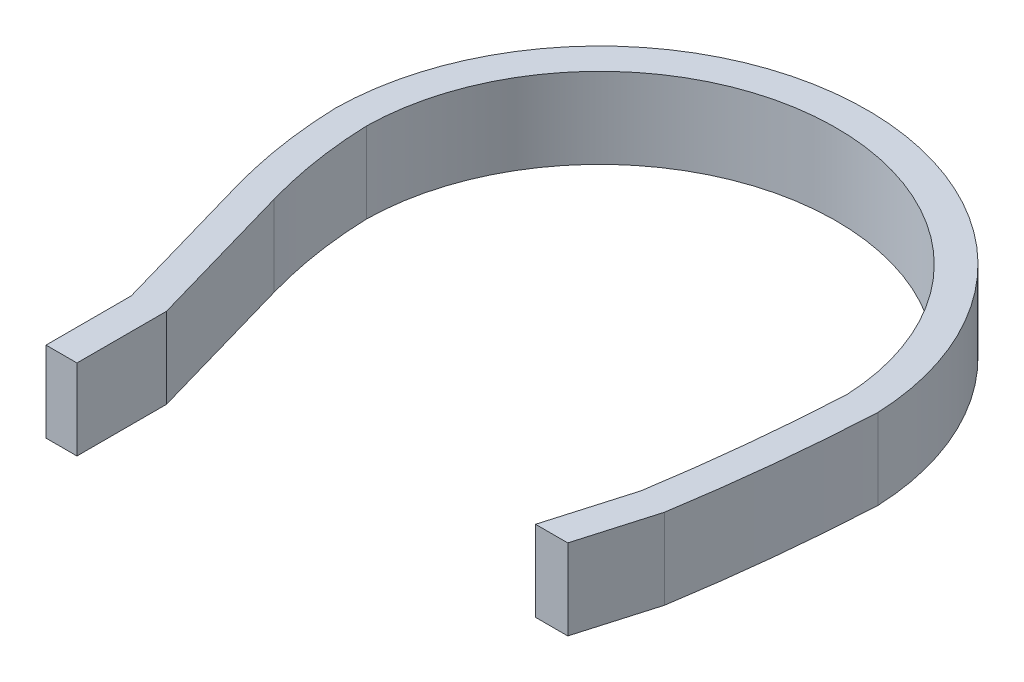
ISO-10303-21;
HEADER;
FILE_DESCRIPTION(('STEP AP214'),'2;1');
FILE_NAME('part.step','',(''),(''),'','','');
FILE_SCHEMA(('AUTOMOTIVE_DESIGN { 1 0 10303 214 1 1 1 1 }'));
ENDSEC;
DATA;
#1=APPLICATION_CONTEXT('core data for automotive mechanical design processes');
#2=APPLICATION_PROTOCOL_DEFINITION('international standard','automotive_design',2000,#1);
#3=PRODUCT_CONTEXT('',#1,'mechanical');
#4=PRODUCT('Part','Part','',(#3));
#5=PRODUCT_RELATED_PRODUCT_CATEGORY('part','',(#4));
#6=PRODUCT_DEFINITION_FORMATION('','',#4);
#7=PRODUCT_DEFINITION_CONTEXT('part definition',#1,'design');
#8=PRODUCT_DEFINITION('design','',#6,#7);
#9=PRODUCT_DEFINITION_SHAPE('','',#8);
#10=(LENGTH_UNIT() NAMED_UNIT(*) SI_UNIT(.MILLI.,.METRE.));
#11=(NAMED_UNIT(*) PLANE_ANGLE_UNIT() SI_UNIT($,.RADIAN.));
#12=(NAMED_UNIT(*) SI_UNIT($,.STERADIAN.) SOLID_ANGLE_UNIT());
#13=UNCERTAINTY_MEASURE_WITH_UNIT(LENGTH_MEASURE(1.E-05),#10,'distance_accuracy_value','');
#14=(GEOMETRIC_REPRESENTATION_CONTEXT(3) GLOBAL_UNCERTAINTY_ASSIGNED_CONTEXT((#13)) GLOBAL_UNIT_ASSIGNED_CONTEXT((#10,
#11,#12)) REPRESENTATION_CONTEXT('',''));
#15=CARTESIAN_POINT('',(0.,0.,0.));
#16=DIRECTION('',(0.,0.,1.));
#17=DIRECTION('',(1.,0.,0.));
#18=AXIS2_PLACEMENT_3D('',#15,#16,#17);
#19=CARTESIAN_POINT('',(-44.6572739608855,0.,0.485687023394847));
#20=DIRECTION('',(1.,0.,0.));
#21=DIRECTION('',(0.,0.,-1.));
#22=AXIS2_PLACEMENT_3D('',#19,#20,#21);
#23=PLANE('',#22);
#24=DIRECTION('',(0.,-1.,0.));
#25=VECTOR('',#24,1.);
#26=CARTESIAN_POINT('',(-44.6572739608855,0.,10.));
#27=LINE('',#26,#25);
#28=CARTESIAN_POINT('',(-44.6572739608855,9.,10.));
#29=VERTEX_POINT('',#28);
#30=CARTESIAN_POINT('',(-44.6572739608855,0.,10.));
#31=VERTEX_POINT('',#30);
#32=EDGE_CURVE('E44',#29,#31,#27,.T.);
#33=ORIENTED_EDGE('',*,*,#32,.F.);
#34=DIRECTION('',(0.,0.,1.));
#35=VECTOR('',#34,1.);
#36=CARTESIAN_POINT('',(-44.6572739608855,9.,0.485687023394847));
#37=LINE('',#36,#35);
#38=CARTESIAN_POINT('',(-44.6572739608855,9.,0.485687023394847));
#39=VERTEX_POINT('',#38);
#40=EDGE_CURVE('E228',#39,#29,#37,.T.);
#41=ORIENTED_EDGE('',*,*,#40,.F.);
#42=DIRECTION('',(0.,1.,0.));
#43=VECTOR('',#42,1.);
#44=CARTESIAN_POINT('',(-44.6572739608855,0.,0.485687023394847));
#45=LINE('',#44,#43);
#46=CARTESIAN_POINT('',(-44.6572739608855,0.,0.485687023394847));
#47=VERTEX_POINT('',#46);
#48=EDGE_CURVE('E224',#47,#39,#45,.T.);
#49=ORIENTED_EDGE('',*,*,#48,.F.);
#50=DIRECTION('',(0.,0.,1.));
#51=VECTOR('',#50,1.);
#52=CARTESIAN_POINT('',(-44.6572739608855,0.,0.485687023394847));
#53=LINE('',#52,#51);
#54=EDGE_CURVE('E236',#47,#31,#53,.T.);
#55=ORIENTED_EDGE('',*,*,#54,.T.);
#56=EDGE_LOOP('',(#33,#41,#49,#55));
#57=FACE_BOUND('',#56,.T.);
#58=ADVANCED_FACE('F35',(#57),#23,.F.);
#59=CARTESIAN_POINT('',(-41.2,0.,0.));
#60=DIRECTION('',(-1.,0.,0.));
#61=DIRECTION('',(0.,0.,1.));
#62=AXIS2_PLACEMENT_3D('',#59,#60,#61);
#63=PLANE('',#62);
#64=DIRECTION('',(0.,1.,0.));
#65=VECTOR('',#64,1.);
#66=CARTESIAN_POINT('',(-41.2,0.,10.));
#67=LINE('',#66,#65);
#68=CARTESIAN_POINT('',(-41.2,0.,10.));
#69=VERTEX_POINT('',#68);
#70=CARTESIAN_POINT('',(-41.2,9.,10.));
#71=VERTEX_POINT('',#70);
#72=EDGE_CURVE('E238',#69,#71,#67,.T.);
#73=ORIENTED_EDGE('',*,*,#72,.F.);
#74=DIRECTION('',(0.,0.,1.));
#75=VECTOR('',#74,1.);
#76=CARTESIAN_POINT('',(-41.2,0.,0.));
#77=LINE('',#76,#75);
#78=CARTESIAN_POINT('',(-41.2,0.,0.));
#79=VERTEX_POINT('',#78);
#80=EDGE_CURVE('E234',#79,#69,#77,.T.);
#81=ORIENTED_EDGE('',*,*,#80,.F.);
#82=DIRECTION('',(0.,-1.,0.));
#83=VECTOR('',#82,1.);
#84=CARTESIAN_POINT('',(-41.2,0.,0.));
#85=LINE('',#84,#83);
#86=CARTESIAN_POINT('',(-41.2,9.,0.));
#87=VERTEX_POINT('',#86);
#88=EDGE_CURVE('E227',#87,#79,#85,.T.);
#89=ORIENTED_EDGE('',*,*,#88,.F.);
#90=DIRECTION('',(0.,0.,1.));
#91=VECTOR('',#90,1.);
#92=CARTESIAN_POINT('',(-41.2,9.,0.));
#93=LINE('',#92,#91);
#94=EDGE_CURVE('E231',#87,#71,#93,.T.);
#95=ORIENTED_EDGE('',*,*,#94,.T.);
#96=EDGE_LOOP('',(#73,#81,#89,#95));
#97=FACE_BOUND('',#96,.T.);
#98=ADVANCED_FACE('F37',(#97),#63,.F.);
#99=CARTESIAN_POINT('',(-46.03,0.,-16.8514687787148));
#100=DIRECTION('',(0.9612931419689,0.,-0.275527666856816));
#101=DIRECTION('',(-0.275527666856816,0.,-0.9612931419689));
#102=AXIS2_PLACEMENT_3D('',#99,#100,#101);
#103=PLANE('',#102);
#104=DIRECTION('',(0.275527666856816,0.,0.9612931419689));
#105=VECTOR('',#104,1.);
#106=CARTESIAN_POINT('',(-46.03,9.,-16.8514687787148));
#107=LINE('',#106,#105);
#108=CARTESIAN_POINT('',(-46.03,9.,-16.8514687787148));
#109=VERTEX_POINT('',#108);
#110=EDGE_CURVE('E212',#109,#87,#107,.T.);
#111=ORIENTED_EDGE('',*,*,#110,.T.);
#112=ORIENTED_EDGE('',*,*,#88,.T.);
#113=DIRECTION('',(0.275527666856816,0.,0.9612931419689));
#114=VECTOR('',#113,1.);
#115=CARTESIAN_POINT('',(-46.03,0.,-16.8514687787148));
#116=LINE('',#115,#114);
#117=CARTESIAN_POINT('',(-46.03,0.,-16.8514687787148));
#118=VERTEX_POINT('',#117);
#119=EDGE_CURVE('E215',#118,#79,#116,.T.);
#120=ORIENTED_EDGE('',*,*,#119,.F.);
#121=DIRECTION('',(0.,1.,0.));
#122=VECTOR('',#121,1.);
#123=CARTESIAN_POINT('',(-46.03,0.,-16.8514687787148));
#124=LINE('',#123,#122);
#125=EDGE_CURVE('E208',#118,#109,#124,.T.);
#126=ORIENTED_EDGE('',*,*,#125,.T.);
#127=EDGE_LOOP('',(#111,#112,#120,#126));
#128=FACE_BOUND('',#127,.T.);
#129=ADVANCED_FACE('F272',(#128),#103,.T.);
#130=CARTESIAN_POINT('',(-49.3534537485069,0.,-15.8988941505872));
#131=DIRECTION('',(-0.9612931419689,0.,0.275527666856816));
#132=DIRECTION('',(0.275527666856816,0.,0.9612931419689));
#133=AXIS2_PLACEMENT_3D('',#130,#131,#132);
#134=PLANE('',#133);
#135=DIRECTION('',(0.275527666856816,0.,0.9612931419689));
#136=VECTOR('',#135,1.);
#137=CARTESIAN_POINT('',(-49.3534537485069,0.,-15.8988941505872));
#138=LINE('',#137,#136);
#139=CARTESIAN_POINT('',(-49.3534537485069,0.,-15.8988941505872));
#140=VERTEX_POINT('',#139);
#141=EDGE_CURVE('E218',#140,#47,#138,.T.);
#142=ORIENTED_EDGE('',*,*,#141,.T.);
#143=ORIENTED_EDGE('',*,*,#48,.T.);
#144=DIRECTION('',(0.275527666856816,0.,0.9612931419689));
#145=VECTOR('',#144,1.);
#146=CARTESIAN_POINT('',(-49.3534537485069,9.,-15.8988941505872));
#147=LINE('',#146,#145);
#148=CARTESIAN_POINT('',(-49.3534537485069,9.,-15.8988941505872));
#149=VERTEX_POINT('',#148);
#150=EDGE_CURVE('E221',#149,#39,#147,.T.);
#151=ORIENTED_EDGE('',*,*,#150,.F.);
#152=DIRECTION('',(0.,1.,0.));
#153=VECTOR('',#152,1.);
#154=CARTESIAN_POINT('',(-49.3534537485069,0.,-15.8988941505872));
#155=LINE('',#154,#153);
#156=EDGE_CURVE('E209',#149,#140,#155,.F.);
#157=ORIENTED_EDGE('',*,*,#156,.T.);
#158=EDGE_LOOP('',(#142,#143,#151,#157));
#159=FACE_BOUND('',#158,.T.);
#160=ADVANCED_FACE('F277',(#159),#134,.T.);
#161=CARTESIAN_POINT('',(2.40936313594606,0.,-30.7352510779847));
#162=DIRECTION('',(0.,1.,0.));
#163=DIRECTION('',(0.,0.,1.));
#164=AXIS2_PLACEMENT_3D('',#161,#162,#163);
#165=CYLINDRICAL_SURFACE('',#164,50.3897937279919);
#166=ORIENTED_EDGE('',*,*,#125,.F.);
#167=CARTESIAN_POINT('',(2.40936313594606,0.,-30.7352510779847));
#168=DIRECTION('',(0.,1.,0.));
#169=DIRECTION('',(0.,0.,1.));
#170=AXIS2_PLACEMENT_3D('',#167,#168,#169);
#171=CIRCLE('',#170,50.3897937279919);
#172=CARTESIAN_POINT('',(-47.9536937952219,0.,-29.0939685010016));
#173=VERTEX_POINT('',#172);
#174=EDGE_CURVE('E198',#173,#118,#171,.T.);
#175=ORIENTED_EDGE('',*,*,#174,.F.);
#176=DIRECTION('',(0.,1.,0.));
#177=VECTOR('',#176,1.);
#178=CARTESIAN_POINT('',(-47.9536937952219,0.,-29.0939685010016));
#179=LINE('',#178,#177);
#180=CARTESIAN_POINT('',(-47.9536937952219,9.,-29.0939685010016));
#181=VERTEX_POINT('',#180);
#182=EDGE_CURVE('E194',#181,#173,#179,.F.);
#183=ORIENTED_EDGE('',*,*,#182,.F.);
#184=CARTESIAN_POINT('',(2.40936313594606,9.,-30.7352510779847));
#185=DIRECTION('',(0.,1.,0.));
#186=DIRECTION('',(0.,0.,1.));
#187=AXIS2_PLACEMENT_3D('',#184,#185,#186);
#188=CIRCLE('',#187,50.3897937279919);
#189=EDGE_CURVE('E195',#181,#109,#188,.T.);
#190=ORIENTED_EDGE('',*,*,#189,.T.);
#191=EDGE_LOOP('',(#166,#175,#183,#190));
#192=FACE_BOUND('',#191,.T.);
#193=ADVANCED_FACE('F269',(#192),#165,.F.);
#194=CARTESIAN_POINT('',(2.40936313594606,0.,-30.7352510779847));
#195=DIRECTION('',(0.,1.,0.));
#196=DIRECTION('',(0.,0.,1.));
#197=AXIS2_PLACEMENT_3D('',#194,#195,#196);
#198=CYLINDRICAL_SURFACE('',#197,53.8470676888773);
#199=ORIENTED_EDGE('',*,*,#156,.F.);
#200=CARTESIAN_POINT('',(2.40936313594606,9.,-30.7352510779847));
#201=DIRECTION('',(0.,1.,0.));
#202=DIRECTION('',(0.,0.,1.));
#203=AXIS2_PLACEMENT_3D('',#200,#201,#202);
#204=CIRCLE('',#203,53.8470676888773);
#205=CARTESIAN_POINT('',(-51.4117175888346,9.,-29.0625382194273));
#206=VERTEX_POINT('',#205);
#207=EDGE_CURVE('E205',#206,#149,#204,.T.);
#208=ORIENTED_EDGE('',*,*,#207,.F.);
#209=DIRECTION('',(0.,1.,0.));
#210=VECTOR('',#209,1.);
#211=CARTESIAN_POINT('',(-51.4117175888346,0.,-29.0625382194273));
#212=LINE('',#211,#210);
#213=CARTESIAN_POINT('',(-51.4117175888346,0.,-29.0625382194273));
#214=VERTEX_POINT('',#213);
#215=EDGE_CURVE('E199',#214,#206,#212,.T.);
#216=ORIENTED_EDGE('',*,*,#215,.F.);
#217=CARTESIAN_POINT('',(2.40936313594606,0.,-30.7352510779847));
#218=DIRECTION('',(0.,1.,0.));
#219=DIRECTION('',(0.,0.,1.));
#220=AXIS2_PLACEMENT_3D('',#217,#218,#219);
#221=CIRCLE('',#220,53.8470676888773);
#222=EDGE_CURVE('E202',#214,#140,#221,.T.);
#223=ORIENTED_EDGE('',*,*,#222,.T.);
#224=EDGE_LOOP('',(#199,#208,#216,#223));
#225=FACE_BOUND('',#224,.T.);
#226=ADVANCED_FACE('F280',(#225),#198,.T.);
#227=CARTESIAN_POINT('',(-21.5455550919685,0.,-28.7136699391711));
#228=DIRECTION('',(0.,1.,0.));
#229=DIRECTION('',(0.,0.,1.));
#230=AXIS2_PLACEMENT_3D('',#227,#228,#229);
#231=CYLINDRICAL_SURFACE('',#230,26.4108768647768);
#232=CARTESIAN_POINT('',(-21.5455550919685,9.,-28.7136699391711));
#233=DIRECTION('',(0.,1.,0.));
#234=DIRECTION('',(0.,0.,1.));
#235=AXIS2_PLACEMENT_3D('',#232,#233,#234);
#236=CIRCLE('',#235,26.4108768647768);
#237=CARTESIAN_POINT('',(4.83699753432634,9.,-29.9365083124599));
#238=VERTEX_POINT('',#237);
#239=EDGE_CURVE('E191',#238,#181,#236,.T.);
#240=ORIENTED_EDGE('',*,*,#239,.T.);
#241=ORIENTED_EDGE('',*,*,#182,.T.);
#242=CARTESIAN_POINT('',(-21.5455550919685,0.,-28.7136699391711));
#243=DIRECTION('',(0.,1.,0.));
#244=DIRECTION('',(0.,0.,1.));
#245=AXIS2_PLACEMENT_3D('',#242,#243,#244);
#246=CIRCLE('',#245,26.4108768647768);
#247=CARTESIAN_POINT('',(4.83699753432634,0.,-29.9365083124599));
#248=VERTEX_POINT('',#247);
#249=EDGE_CURVE('E181',#248,#173,#246,.T.);
#250=ORIENTED_EDGE('',*,*,#249,.F.);
#251=DIRECTION('',(0.,1.,0.));
#252=VECTOR('',#251,1.);
#253=CARTESIAN_POINT('',(4.83699753432634,0.,-29.9365083124599));
#254=LINE('',#253,#252);
#255=EDGE_CURVE('E185',#248,#238,#254,.T.);
#256=ORIENTED_EDGE('',*,*,#255,.T.);
#257=EDGE_LOOP('',(#240,#241,#250,#256));
#258=FACE_BOUND('',#257,.T.);
#259=ADVANCED_FACE('F260',(#258),#231,.F.);
#260=CARTESIAN_POINT('',(-21.5455550919685,0.,-28.7136699391711));
#261=DIRECTION('',(0.,1.,0.));
#262=DIRECTION('',(0.,0.,1.));
#263=AXIS2_PLACEMENT_3D('',#260,#261,#262);
#264=CYLINDRICAL_SURFACE('',#263,29.8682000021123);
#265=CARTESIAN_POINT('',(-21.5455550919685,0.,-28.7136699391711));
#266=DIRECTION('',(0.,1.,0.));
#267=DIRECTION('',(0.,0.,1.));
#268=AXIS2_PLACEMENT_3D('',#265,#266,#267);
#269=CIRCLE('',#268,29.8682000021123);
#270=CARTESIAN_POINT('',(8.29798848813998,0.,-29.9270445508846));
#271=VERTEX_POINT('',#270);
#272=EDGE_CURVE('E184',#271,#214,#269,.T.);
#273=ORIENTED_EDGE('',*,*,#272,.T.);
#274=ORIENTED_EDGE('',*,*,#215,.T.);
#275=CARTESIAN_POINT('',(-21.5455550919685,9.,-28.7136699391711));
#276=DIRECTION('',(0.,1.,0.));
#277=DIRECTION('',(0.,0.,1.));
#278=AXIS2_PLACEMENT_3D('',#275,#276,#277);
#279=CIRCLE('',#278,29.8682000021123);
#280=CARTESIAN_POINT('',(8.29798848813998,9.,-29.9270445508846));
#281=VERTEX_POINT('',#280);
#282=EDGE_CURVE('E188',#281,#206,#279,.T.);
#283=ORIENTED_EDGE('',*,*,#282,.F.);
#284=DIRECTION('',(0.,1.,0.));
#285=VECTOR('',#284,1.);
#286=CARTESIAN_POINT('',(8.29798848813998,0.,-29.9270445508846));
#287=LINE('',#286,#285);
#288=EDGE_CURVE('E180',#281,#271,#287,.F.);
#289=ORIENTED_EDGE('',*,*,#288,.T.);
#290=EDGE_LOOP('',(#273,#274,#283,#289));
#291=FACE_BOUND('',#290,.T.);
#292=ADVANCED_FACE('F282',(#291),#264,.T.);
#293=CARTESIAN_POINT('',(-193.071013591026,0.,-40.194528430915));
#294=DIRECTION('',(0.,1.,0.));
#295=DIRECTION('',(0.,0.,1.));
#296=AXIS2_PLACEMENT_3D('',#293,#294,#295);
#297=CYLINDRICAL_SURFACE('',#296,198.173681008209);
#298=ORIENTED_EDGE('',*,*,#255,.F.);
#299=CARTESIAN_POINT('',(-193.071013591026,0.,-40.194528430915));
#300=DIRECTION('',(0.,1.,0.));
#301=DIRECTION('',(0.,0.,1.));
#302=AXIS2_PLACEMENT_3D('',#299,#300,#301);
#303=CIRCLE('',#302,198.173681008209);
#304=CARTESIAN_POINT('',(2.65,0.,-9.11249691357973));
#305=VERTEX_POINT('',#304);
#306=EDGE_CURVE('E169',#305,#248,#303,.T.);
#307=ORIENTED_EDGE('',*,*,#306,.F.);
#308=DIRECTION('',(0.,-1.,0.));
#309=VECTOR('',#308,1.);
#310=CARTESIAN_POINT('',(2.65,0.,-9.11249691357972));
#311=LINE('',#310,#309);
#312=CARTESIAN_POINT('',(2.65,9.,-9.11249691357972));
#313=VERTEX_POINT('',#312);
#314=EDGE_CURVE('E139',#313,#305,#311,.T.);
#315=ORIENTED_EDGE('',*,*,#314,.F.);
#316=CARTESIAN_POINT('',(-193.071013591026,9.,-40.194528430915));
#317=DIRECTION('',(0.,1.,0.));
#318=DIRECTION('',(0.,0.,1.));
#319=AXIS2_PLACEMENT_3D('',#316,#317,#318);
#320=CIRCLE('',#319,198.173681008209);
#321=EDGE_CURVE('E177',#313,#238,#320,.T.);
#322=ORIENTED_EDGE('',*,*,#321,.T.);
#323=EDGE_LOOP('',(#298,#307,#315,#322));
#324=FACE_BOUND('',#323,.T.);
#325=ADVANCED_FACE('F262',(#324),#297,.F.);
#326=CARTESIAN_POINT('',(-193.071013591026,0.,-40.194528430915));
#327=DIRECTION('',(0.,1.,0.));
#328=DIRECTION('',(0.,0.,1.));
#329=AXIS2_PLACEMENT_3D('',#326,#327,#328);
#330=CYLINDRICAL_SURFACE('',#329,201.630593471293);
#331=ORIENTED_EDGE('',*,*,#288,.F.);
#332=CARTESIAN_POINT('',(-193.071013591026,9.,-40.194528430915));
#333=DIRECTION('',(0.,1.,0.));
#334=DIRECTION('',(0.,0.,1.));
#335=AXIS2_PLACEMENT_3D('',#332,#333,#334);
#336=CIRCLE('',#335,201.630593471293);
#337=CARTESIAN_POINT('',(6.02994385636054,9.,-8.35579467594621));
#338=VERTEX_POINT('',#337);
#339=EDGE_CURVE('E174',#338,#281,#336,.T.);
#340=ORIENTED_EDGE('',*,*,#339,.F.);
#341=DIRECTION('',(0.,1.,0.));
#342=VECTOR('',#341,1.);
#343=CARTESIAN_POINT('',(6.02994385636054,0.,-8.35579467594621));
#344=LINE('',#343,#342);
#345=CARTESIAN_POINT('',(6.02994385636054,0.,-8.35579467594621));
#346=VERTEX_POINT('',#345);
#347=EDGE_CURVE('E158',#346,#338,#344,.T.);
#348=ORIENTED_EDGE('',*,*,#347,.F.);
#349=CARTESIAN_POINT('',(-193.071013591026,0.,-40.194528430915));
#350=DIRECTION('',(0.,1.,0.));
#351=DIRECTION('',(0.,0.,1.));
#352=AXIS2_PLACEMENT_3D('',#349,#350,#351);
#353=CIRCLE('',#352,201.630593471293);
#354=EDGE_CURVE('E171',#346,#271,#353,.T.);
#355=ORIENTED_EDGE('',*,*,#354,.T.);
#356=EDGE_LOOP('',(#331,#340,#348,#355));
#357=FACE_BOUND('',#356,.T.);
#358=ADVANCED_FACE('F286',(#357),#330,.T.);
#359=CARTESIAN_POINT('',(0.,0.,0.));
#360=DIRECTION('',(0.,0.,-1.));
#361=DIRECTION('',(-1.,0.,0.));
#362=AXIS2_PLACEMENT_3D('',#359,#360,#361);
#363=PLANE('',#362);
#364=DIRECTION('',(0.,-1.,0.));
#365=VECTOR('',#364,1.);
#366=CARTESIAN_POINT('',(0.,0.,0.));
#367=LINE('',#366,#365);
#368=CARTESIAN_POINT('',(0.,9.,0.));
#369=VERTEX_POINT('',#368);
#370=CARTESIAN_POINT('',(0.,0.,0.));
#371=VERTEX_POINT('',#370);
#372=EDGE_CURVE('E136',#369,#371,#367,.T.);
#373=ORIENTED_EDGE('',*,*,#372,.T.);
#374=DIRECTION('',(1.,0.,0.));
#375=VECTOR('',#374,1.);
#376=CARTESIAN_POINT('',(0.,0.,0.));
#377=LINE('',#376,#375);
#378=CARTESIAN_POINT('',(3.6,0.,0.));
#379=VERTEX_POINT('',#378);
#380=EDGE_CURVE('E146',#371,#379,#377,.T.);
#381=ORIENTED_EDGE('',*,*,#380,.T.);
#382=DIRECTION('',(0.,1.,0.));
#383=VECTOR('',#382,1.);
#384=CARTESIAN_POINT('',(3.6,0.,0.));
#385=LINE('',#384,#383);
#386=CARTESIAN_POINT('',(3.6,9.,0.));
#387=VERTEX_POINT('',#386);
#388=EDGE_CURVE('E152',#379,#387,#385,.T.);
#389=ORIENTED_EDGE('',*,*,#388,.T.);
#390=DIRECTION('',(-1.,0.,0.));
#391=VECTOR('',#390,1.);
#392=CARTESIAN_POINT('',(0.,9.,0.));
#393=LINE('',#392,#391);
#394=EDGE_CURVE('E143',#387,#369,#393,.T.);
#395=ORIENTED_EDGE('',*,*,#394,.T.);
#396=EDGE_LOOP('',(#373,#381,#389,#395));
#397=FACE_BOUND('',#396,.T.);
#398=ADVANCED_FACE('F154',(#397),#363,.F.);
#399=CARTESIAN_POINT('',(5.24674075115515,0.,-18.0418524155676));
#400=DIRECTION('',(-0.96022096033506,0.,-0.279241306638567));
#401=DIRECTION('',(-0.279241306638567,0.,0.960220960335061));
#402=AXIS2_PLACEMENT_3D('',#399,#400,#401);
#403=PLANE('',#402);
#404=DIRECTION('',(-0.279241306638567,0.,0.96022096033506));
#405=VECTOR('',#404,1.);
#406=CARTESIAN_POINT('',(5.24674075115515,9.,-18.0418524155676));
#407=LINE('',#406,#405);
#408=EDGE_CURVE('E163',#313,#369,#407,.T.);
#409=ORIENTED_EDGE('',*,*,#408,.F.);
#410=ORIENTED_EDGE('',*,*,#314,.T.);
#411=DIRECTION('',(-0.279241306638567,0.,0.96022096033506));
#412=VECTOR('',#411,1.);
#413=CARTESIAN_POINT('',(5.24674075115515,0.,-18.0418524155676));
#414=LINE('',#413,#412);
#415=EDGE_CURVE('E131',#305,#371,#414,.T.);
#416=ORIENTED_EDGE('',*,*,#415,.T.);
#417=ORIENTED_EDGE('',*,*,#372,.F.);
#418=EDGE_LOOP('',(#409,#410,#416,#417));
#419=FACE_BOUND('',#418,.T.);
#420=ADVANCED_FACE('F134',(#419),#403,.T.);
#421=CARTESIAN_POINT('',(5.24674075115515,9.,-18.0418524155676));
#422=DIRECTION('',(0.,1.,0.));
#423=DIRECTION('',(0.,0.,1.));
#424=AXIS2_PLACEMENT_3D('',#421,#422,#423);
#425=PLANE('',#424);
#426=DIRECTION('',(-0.279241306638567,0.,0.96022096033506));
#427=VECTOR('',#426,1.);
#428=CARTESIAN_POINT('',(8.84674075115515,9.,-18.0418524155676));
#429=LINE('',#428,#427);
#430=EDGE_CURVE('E165',#338,#387,#429,.T.);
#431=ORIENTED_EDGE('',*,*,#430,.F.);
#432=ORIENTED_EDGE('',*,*,#339,.T.);
#433=ORIENTED_EDGE('',*,*,#282,.T.);
#434=ORIENTED_EDGE('',*,*,#207,.T.);
#435=ORIENTED_EDGE('',*,*,#150,.T.);
#436=ORIENTED_EDGE('',*,*,#40,.T.);
#437=DIRECTION('',(-1.,0.,0.));
#438=VECTOR('',#437,1.);
#439=CARTESIAN_POINT('',(6.30255532693175,9.,10.));
#440=LINE('',#439,#438);
#441=EDGE_CURVE('E242',#71,#29,#440,.T.);
#442=ORIENTED_EDGE('',*,*,#441,.F.);
#443=ORIENTED_EDGE('',*,*,#94,.F.);
#444=ORIENTED_EDGE('',*,*,#110,.F.);
#445=ORIENTED_EDGE('',*,*,#189,.F.);
#446=ORIENTED_EDGE('',*,*,#239,.F.);
#447=ORIENTED_EDGE('',*,*,#321,.F.);
#448=ORIENTED_EDGE('',*,*,#408,.T.);
#449=ORIENTED_EDGE('',*,*,#394,.F.);
#450=EDGE_LOOP('',(#431,#432,#433,#434,#435,#436,#442,#443,#444,#445,#446,#447,#448,#449));
#451=FACE_BOUND('',#450,.T.);
#452=ADVANCED_FACE('F265',(#451),#425,.T.);
#453=CARTESIAN_POINT('',(8.84674075115515,0.,-18.0418524155676));
#454=DIRECTION('',(0.96022096033506,0.,0.279241306638567));
#455=DIRECTION('',(0.279241306638567,0.,-0.960220960335061));
#456=AXIS2_PLACEMENT_3D('',#453,#454,#455);
#457=PLANE('',#456);
#458=DIRECTION('',(-0.279241306638567,0.,0.96022096033506));
#459=VECTOR('',#458,1.);
#460=CARTESIAN_POINT('',(8.84674075115515,0.,-18.0418524155676));
#461=LINE('',#460,#459);
#462=EDGE_CURVE('E142',#346,#379,#461,.T.);
#463=ORIENTED_EDGE('',*,*,#462,.F.);
#464=ORIENTED_EDGE('',*,*,#347,.T.);
#465=ORIENTED_EDGE('',*,*,#430,.T.);
#466=ORIENTED_EDGE('',*,*,#388,.F.);
#467=EDGE_LOOP('',(#463,#464,#465,#466));
#468=FACE_BOUND('',#467,.T.);
#469=ADVANCED_FACE('F289',(#468),#457,.T.);
#470=CARTESIAN_POINT('',(5.24674075115515,0.,-18.0418524155676));
#471=DIRECTION('',(0.,-1.,0.));
#472=DIRECTION('',(0.,0.,-1.));
#473=AXIS2_PLACEMENT_3D('',#470,#471,#472);
#474=PLANE('',#473);
#475=ORIENTED_EDGE('',*,*,#415,.F.);
#476=ORIENTED_EDGE('',*,*,#306,.T.);
#477=ORIENTED_EDGE('',*,*,#249,.T.);
#478=ORIENTED_EDGE('',*,*,#174,.T.);
#479=ORIENTED_EDGE('',*,*,#119,.T.);
#480=ORIENTED_EDGE('',*,*,#80,.T.);
#481=DIRECTION('',(1.,0.,0.));
#482=VECTOR('',#481,1.);
#483=CARTESIAN_POINT('',(6.30255532693175,0.,10.));
#484=LINE('',#483,#482);
#485=EDGE_CURVE('E12',#31,#69,#484,.T.);
#486=ORIENTED_EDGE('',*,*,#485,.F.);
#487=ORIENTED_EDGE('',*,*,#54,.F.);
#488=ORIENTED_EDGE('',*,*,#141,.F.);
#489=ORIENTED_EDGE('',*,*,#222,.F.);
#490=ORIENTED_EDGE('',*,*,#272,.F.);
#491=ORIENTED_EDGE('',*,*,#354,.F.);
#492=ORIENTED_EDGE('',*,*,#462,.T.);
#493=ORIENTED_EDGE('',*,*,#380,.F.);
#494=EDGE_LOOP('',(#475,#476,#477,#478,#479,#480,#486,#487,#488,#489,#490,#491,#492,#493));
#495=FACE_BOUND('',#494,.T.);
#496=ADVANCED_FACE('F147',(#495),#474,.T.);
#497=CARTESIAN_POINT('',(-42.9286369804428,4.5,10.));
#498=DIRECTION('',(0.,0.,1.));
#499=DIRECTION('',(1.,0.,0.));
#500=AXIS2_PLACEMENT_3D('',#497,#498,#499);
#501=PLANE('',#500);
#502=ORIENTED_EDGE('',*,*,#32,.T.);
#503=ORIENTED_EDGE('',*,*,#485,.T.);
#504=ORIENTED_EDGE('',*,*,#72,.T.);
#505=ORIENTED_EDGE('',*,*,#441,.T.);
#506=EDGE_LOOP('',(#502,#503,#504,#505));
#507=FACE_BOUND('',#506,.T.);
#508=ADVANCED_FACE('F274',(#507),#501,.T.);
#509=CLOSED_SHELL('',(#58,#98,#129,#160,#193,#226,#259,#292,#325,#358,#398,#420,#452,#469,#496,#508));
#510=MANIFOLD_SOLID_BREP('B2',#509);
#511=ADVANCED_BREP_SHAPE_REPRESENTATION('',(#18,#510),#14);
#512=SHAPE_DEFINITION_REPRESENTATION(#9,#511);
ENDSEC;
END-ISO-10303-21;
